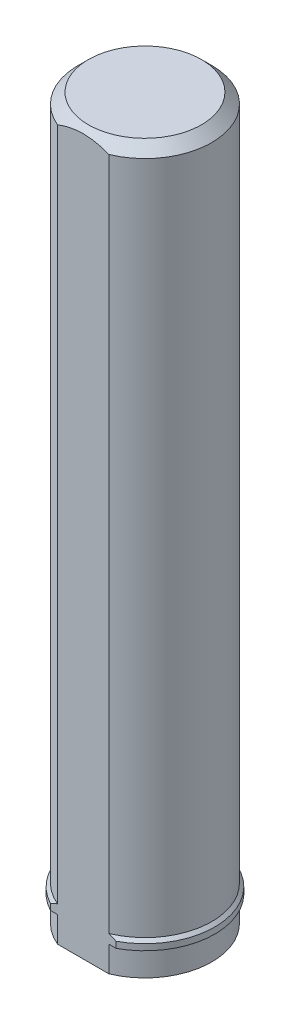
ISO-10303-21;
HEADER;
FILE_DESCRIPTION(('STEP AP214'),'2;1');
FILE_NAME('part.step','',(''),(''),'','','');
FILE_SCHEMA(('AUTOMOTIVE_DESIGN { 1 0 10303 214 1 1 1 1 }'));
ENDSEC;
DATA;
#1=APPLICATION_CONTEXT('core data for automotive mechanical design processes');
#2=APPLICATION_PROTOCOL_DEFINITION('international standard','automotive_design',2000,#1);
#3=PRODUCT_CONTEXT('',#1,'mechanical');
#4=PRODUCT('Part','Part','',(#3));
#5=PRODUCT_RELATED_PRODUCT_CATEGORY('part','',(#4));
#6=PRODUCT_DEFINITION_FORMATION('','',#4);
#7=PRODUCT_DEFINITION_CONTEXT('part definition',#1,'design');
#8=PRODUCT_DEFINITION('design','',#6,#7);
#9=PRODUCT_DEFINITION_SHAPE('','',#8);
#10=(LENGTH_UNIT() NAMED_UNIT(*) SI_UNIT(.MILLI.,.METRE.));
#11=(NAMED_UNIT(*) PLANE_ANGLE_UNIT() SI_UNIT($,.RADIAN.));
#12=(NAMED_UNIT(*) SI_UNIT($,.STERADIAN.) SOLID_ANGLE_UNIT());
#13=UNCERTAINTY_MEASURE_WITH_UNIT(LENGTH_MEASURE(1.E-05),#10,'distance_accuracy_value','');
#14=(GEOMETRIC_REPRESENTATION_CONTEXT(3) GLOBAL_UNCERTAINTY_ASSIGNED_CONTEXT((#13)) GLOBAL_UNIT_ASSIGNED_CONTEXT((#10,
#11,#12)) REPRESENTATION_CONTEXT('',''));
#15=CARTESIAN_POINT('',(0.,0.,0.));
#16=DIRECTION('',(0.,0.,1.));
#17=DIRECTION('',(1.,0.,0.));
#18=AXIS2_PLACEMENT_3D('',#15,#16,#17);
#19=CARTESIAN_POINT('',(0.,17.5,0.));
#20=DIRECTION('',(0.,-1.,0.));
#21=DIRECTION('',(0.,0.,-1.));
#22=AXIS2_PLACEMENT_3D('',#19,#20,#21);
#23=CYLINDRICAL_SURFACE('',#22,3.25);
#24=DIRECTION('',(0.,-1.,0.));
#25=VECTOR('',#24,1.);
#26=CARTESIAN_POINT('',(-1.25,17.5,3.));
#27=LINE('',#26,#25);
#28=CARTESIAN_POINT('',(-1.25,17.,3.));
#29=VERTEX_POINT('',#28);
#30=CARTESIAN_POINT('',(-1.25,-15.8,3.));
#31=VERTEX_POINT('',#30);
#32=EDGE_CURVE('E153',#29,#31,#27,.T.);
#33=ORIENTED_EDGE('',*,*,#32,.F.);
#34=CARTESIAN_POINT('',(0.,17.,0.));
#35=DIRECTION('',(0.,1.,0.));
#36=DIRECTION('',(0.,0.,1.));
#37=AXIS2_PLACEMENT_3D('',#34,#35,#36);
#38=CIRCLE('',#37,3.25);
#39=CARTESIAN_POINT('',(1.25,17.,3.));
#40=VERTEX_POINT('',#39);
#41=EDGE_CURVE('E61',#29,#40,#38,.F.);
#42=ORIENTED_EDGE('',*,*,#41,.T.);
#43=DIRECTION('',(0.,-1.,0.));
#44=VECTOR('',#43,1.);
#45=CARTESIAN_POINT('',(1.25,17.5,3.));
#46=LINE('',#45,#44);
#47=CARTESIAN_POINT('',(1.25,-15.8,3.));
#48=VERTEX_POINT('',#47);
#49=EDGE_CURVE('E149',#40,#48,#46,.T.);
#50=ORIENTED_EDGE('',*,*,#49,.T.);
#51=CARTESIAN_POINT('',(0.,-15.8,0.));
#52=DIRECTION('',(0.,-1.,0.));
#53=DIRECTION('',(0.,0.,-1.));
#54=AXIS2_PLACEMENT_3D('',#51,#52,#53);
#55=CIRCLE('',#54,3.25);
#56=EDGE_CURVE('E217',#48,#31,#55,.F.);
#57=ORIENTED_EDGE('',*,*,#56,.T.);
#58=EDGE_LOOP('',(#33,#42,#50,#57));
#59=FACE_BOUND('',#58,.T.);
#60=ADVANCED_FACE('F45',(#59),#23,.T.);
#61=CARTESIAN_POINT('',(-1.25,-16.25,3.));
#62=VERTEX_POINT('',#61);
#63=CARTESIAN_POINT('',(-1.25,-17.5,3.));
#64=VERTEX_POINT('',#63);
#65=EDGE_CURVE('E152',#62,#64,#27,.T.);
#66=ORIENTED_EDGE('',*,*,#65,.F.);
#67=CARTESIAN_POINT('',(0.,-16.25,0.));
#68=DIRECTION('',(0.,1.,0.));
#69=DIRECTION('',(0.,0.,-1.));
#70=AXIS2_PLACEMENT_3D('',#67,#68,#69);
#71=CIRCLE('',#70,3.25);
#72=CARTESIAN_POINT('',(1.25,-16.25,3.));
#73=VERTEX_POINT('',#72);
#74=EDGE_CURVE('E130',#73,#62,#71,.T.);
#75=ORIENTED_EDGE('',*,*,#74,.F.);
#76=CARTESIAN_POINT('',(1.25,-17.5,3.));
#77=VERTEX_POINT('',#76);
#78=EDGE_CURVE('E148',#73,#77,#46,.T.);
#79=ORIENTED_EDGE('',*,*,#78,.T.);
#80=CARTESIAN_POINT('',(0.,-17.5,0.));
#81=DIRECTION('',(0.,1.,0.));
#82=DIRECTION('',(0.,0.,1.));
#83=AXIS2_PLACEMENT_3D('',#80,#81,#82);
#84=CIRCLE('',#83,3.25);
#85=EDGE_CURVE('E139',#77,#64,#84,.T.);
#86=ORIENTED_EDGE('',*,*,#85,.T.);
#87=EDGE_LOOP('',(#66,#75,#79,#86));
#88=FACE_BOUND('',#87,.T.);
#89=ADVANCED_FACE('F179',(#88),#23,.T.);
#90=CARTESIAN_POINT('',(-1.25,17.5,3.));
#91=DIRECTION('',(0.,0.,-1.));
#92=DIRECTION('',(-1.,0.,0.));
#93=AXIS2_PLACEMENT_3D('',#90,#91,#92);
#94=PLANE('',#93);
#95=ORIENTED_EDGE('',*,*,#49,.F.);
#96=CARTESIAN_POINT('',(1.25,17.,3.));
#97=CARTESIAN_POINT('',(1.15236802083105,17.037571882083,3.));
#98=CARTESIAN_POINT('',(1.05336204969655,17.0718854263408,3.));
#99=CARTESIAN_POINT('',(0.852725448941351,17.1326265317615,3.));
#100=CARTESIAN_POINT('',(0.751089244504002,17.159035543992,3.));
#101=CARTESIAN_POINT('',(0.548493250122633,17.2018352585442,3.));
#102=CARTESIAN_POINT('',(0.447586877927029,17.218472843084,3.));
#103=CARTESIAN_POINT('',(0.24470611508165,17.2417200779359,3.));
#104=CARTESIAN_POINT('',(0.142732885989917,17.2483396815345,3.));
#105=CARTESIAN_POINT('',(-0.0578920074181225,17.2510614991039,3.));
#106=CARTESIAN_POINT('',(-0.156538957355599,17.247513000227,3.));
#107=CARTESIAN_POINT('',(-0.353047249224438,17.2308860418104,3.));
#108=CARTESIAN_POINT('',(-0.450908287707399,17.2178040647867,3.));
#109=CARTESIAN_POINT('',(-0.646385819993985,17.1826834722514,3.));
#110=CARTESIAN_POINT('',(-0.743980132667026,17.1605232520617,3.));
#111=CARTESIAN_POINT('',(-0.937016203307981,17.1084456394706,3.));
#112=CARTESIAN_POINT('',(-1.03245832486017,17.0785295681526,3.));
#113=CARTESIAN_POINT('',(-1.32842957153948,16.974488345219,3.));
#114=CARTESIAN_POINT('',(-1.52490969147315,16.888803613196,3.));
#115=CARTESIAN_POINT('',(-1.81250176256394,16.745966896015,3.));
#116=CARTESIAN_POINT('',(-1.90735595857642,16.6958578016377,3.));
#117=CARTESIAN_POINT('',(-2.09492458656542,16.5917743788511,3.));
#118=CARTESIAN_POINT('',(-2.18763938699844,16.5378007226841,3.));
#119=CARTESIAN_POINT('',(-2.36803930017192,16.4286608111215,3.));
#120=CARTESIAN_POINT('',(-2.45578798483039,16.3735984740863,3.));
#121=CARTESIAN_POINT('',(-2.62976374299449,16.2611083733608,3.));
#122=CARTESIAN_POINT('',(-2.71599069300599,16.2036804189419,3.));
#123=CARTESIAN_POINT('',(-2.88641961075787,16.0873609946428,3.));
#124=CARTESIAN_POINT('',(-2.97063234675973,16.0284852362516,3.));
#125=CARTESIAN_POINT('',(-3.13789321586839,15.909150340196,3.));
#126=CARTESIAN_POINT('',(-3.22094167668757,15.848691662402,3.));
#127=CARTESIAN_POINT('',(-3.30350342880287,15.7875864261465,3.));
#128=B_SPLINE_CURVE_WITH_KNOTS('',3,(#96,#97,#98,#99,#100,#101,#102,#103,#104,#105,#106,#107,
#108,#109,#110,#111,#112,#113,#114,#115,#116,#117,#118,#119,#120,#121,#122,#123,#124,#125,#126,
#127),.UNSPECIFIED.,.F.,.F.,(4,2,2,2,2,2,2,2,2,2,2,2,2,2,2,4),(0.,0.313947136940307,
0.628625314452549,0.934966611069567,1.24100334441469,1.53665464320437,1.83241508112559,
2.1322740260672,2.43208192842627,3.07316816171331,3.39497040337175,3.71671680275457,
4.02745936200872,4.33822702421672,4.64646590327196,4.9546162051363),.UNSPECIFIED.);
#129=EDGE_CURVE('E11',#40,#29,#128,.T.);
#130=ORIENTED_EDGE('',*,*,#129,.T.);
#131=ORIENTED_EDGE('',*,*,#32,.T.);
#132=CARTESIAN_POINT('',(-1.25,-15.8,3.));
#133=CARTESIAN_POINT('',(-1.27962939360583,-15.8113960988494,3.));
#134=CARTESIAN_POINT('',(-1.30914257840903,-15.823092392511,3.));
#135=CARTESIAN_POINT('',(-1.36792931558873,-15.847045652047,3.));
#136=CARTESIAN_POINT('',(-1.39720294374067,-15.8593024318564,3.));
#137=CARTESIAN_POINT('',(-1.45552217219404,-15.884344201363,3.));
#138=CARTESIAN_POINT('',(-1.48456777802003,-15.8971291782157,3.));
#139=CARTESIAN_POINT('',(-1.54244546525888,-15.9231988773122,3.));
#140=CARTESIAN_POINT('',(-1.5712774731186,-15.9364837629256,3.));
#141=CARTESIAN_POINT('',(-1.60000000000004,-15.9499999999999,3.));
#142=B_SPLINE_CURVE_WITH_KNOTS('',3,(#132,#133,#134,#135,#136,#137,#138,#139,#140,#141),
.UNSPECIFIED.,.F.,.F.,(4,2,2,2,4),(0.,0.095233642088486,0.190435895693011,0.285635835561756,
0.380867161552525),.UNSPECIFIED.);
#143=CARTESIAN_POINT('',(-1.6,-15.95,3.));
#144=VERTEX_POINT('',#143);
#145=EDGE_CURVE('E112',#31,#144,#142,.T.);
#146=ORIENTED_EDGE('',*,*,#145,.T.);
#147=DIRECTION('',(0.,-1.,0.));
#148=VECTOR('',#147,1.);
#149=CARTESIAN_POINT('',(-1.6,-15.75,3.));
#150=LINE('',#149,#148);
#151=CARTESIAN_POINT('',(-1.6,-16.25,3.));
#152=VERTEX_POINT('',#151);
#153=EDGE_CURVE('E105',#144,#152,#150,.T.);
#154=ORIENTED_EDGE('',*,*,#153,.T.);
#155=DIRECTION('',(-1.,0.,0.));
#156=VECTOR('',#155,1.);
#157=CARTESIAN_POINT('',(-1.25,-16.25,3.));
#158=LINE('',#157,#156);
#159=EDGE_CURVE('E109',#62,#152,#158,.T.);
#160=ORIENTED_EDGE('',*,*,#159,.F.);
#161=ORIENTED_EDGE('',*,*,#65,.T.);
#162=DIRECTION('',(1.,0.,0.));
#163=VECTOR('',#162,1.);
#164=CARTESIAN_POINT('',(-1.25,-17.5,3.));
#165=LINE('',#164,#163);
#166=EDGE_CURVE('E144',#64,#77,#165,.T.);
#167=ORIENTED_EDGE('',*,*,#166,.T.);
#168=ORIENTED_EDGE('',*,*,#78,.F.);
#169=DIRECTION('',(-1.,0.,0.));
#170=VECTOR('',#169,1.);
#171=CARTESIAN_POINT('',(1.25,-16.25,3.));
#172=LINE('',#171,#170);
#173=CARTESIAN_POINT('',(1.6,-16.25,3.));
#174=VERTEX_POINT('',#173);
#175=EDGE_CURVE('E118',#174,#73,#172,.T.);
#176=ORIENTED_EDGE('',*,*,#175,.F.);
#177=DIRECTION('',(0.,-1.,0.));
#178=VECTOR('',#177,1.);
#179=CARTESIAN_POINT('',(1.6,-15.75,3.));
#180=LINE('',#179,#178);
#181=CARTESIAN_POINT('',(1.6,-15.95,3.));
#182=VERTEX_POINT('',#181);
#183=EDGE_CURVE('E117',#182,#174,#180,.T.);
#184=ORIENTED_EDGE('',*,*,#183,.F.);
#185=CARTESIAN_POINT('',(1.6,-15.95,3.));
#186=CARTESIAN_POINT('',(1.57127747311858,-15.9364837629256,3.));
#187=CARTESIAN_POINT('',(1.54244546525888,-15.9231988773122,3.));
#188=CARTESIAN_POINT('',(1.48456777802004,-15.8971291782157,3.));
#189=CARTESIAN_POINT('',(1.45552217219405,-15.884344201363,3.));
#190=CARTESIAN_POINT('',(1.39720294374067,-15.8593024318564,3.));
#191=CARTESIAN_POINT('',(1.36792931558873,-15.8470456520471,3.));
#192=CARTESIAN_POINT('',(1.30914257840906,-15.823092392511,3.));
#193=CARTESIAN_POINT('',(1.2796293936059,-15.8113960988493,3.));
#194=CARTESIAN_POINT('',(1.25000000000015,-15.7999999999997,3.));
#195=B_SPLINE_CURVE_WITH_KNOTS('',3,(#185,#186,#187,#188,#189,#190,#191,#192,#193,#194),
.UNSPECIFIED.,.F.,.F.,(4,2,2,2,4),(0.,0.095231325990767,0.190431265859513,0.285633519464035,
0.38086716155251),.UNSPECIFIED.);
#196=EDGE_CURVE('E165',#182,#48,#195,.T.);
#197=ORIENTED_EDGE('',*,*,#196,.T.);
#198=EDGE_LOOP('',(#95,#130,#131,#146,#154,#160,#161,#167,#168,#176,#184,#197));
#199=FACE_BOUND('',#198,.T.);
#200=ADVANCED_FACE('F107',(#199),#94,.F.);
#201=CARTESIAN_POINT('',(0.,17.5,0.));
#202=DIRECTION('',(0.,1.,0.));
#203=DIRECTION('',(0.,0.,1.));
#204=AXIS2_PLACEMENT_3D('',#201,#202,#203);
#205=PLANE('',#204);
#206=CARTESIAN_POINT('',(0.,17.5,0.));
#207=DIRECTION('',(0.,1.,0.));
#208=DIRECTION('',(0.,0.,1.));
#209=AXIS2_PLACEMENT_3D('',#206,#207,#208);
#210=CIRCLE('',#209,2.75);
#211=CARTESIAN_POINT('',(1.05769230769231,17.5,2.53846153846154));
#212=VERTEX_POINT('',#211);
#213=EDGE_CURVE('E66',#212,#212,#210,.T.);
#214=ORIENTED_EDGE('',*,*,#213,.T.);
#215=EDGE_LOOP('',(#214));
#216=FACE_BOUND('',#215,.T.);
#217=ADVANCED_FACE('F178',(#216),#205,.T.);
#218=CARTESIAN_POINT('',(0.,-17.5,0.));
#219=DIRECTION('',(0.,1.,0.));
#220=DIRECTION('',(0.,0.,1.));
#221=AXIS2_PLACEMENT_3D('',#218,#219,#220);
#222=PLANE('',#221);
#223=ORIENTED_EDGE('',*,*,#85,.F.);
#224=ORIENTED_EDGE('',*,*,#166,.F.);
#225=EDGE_LOOP('',(#223,#224));
#226=FACE_BOUND('',#225,.T.);
#227=ADVANCED_FACE('F180',(#226),#222,.F.);
#228=CARTESIAN_POINT('',(0.,-15.75,0.));
#229=DIRECTION('',(0.,-1.,0.));
#230=DIRECTION('',(0.,0.,-1.));
#231=AXIS2_PLACEMENT_3D('',#228,#229,#230);
#232=CYLINDRICAL_SURFACE('',#231,3.4);
#233=ORIENTED_EDGE('',*,*,#153,.F.);
#234=CARTESIAN_POINT('',(0.,-15.95,0.));
#235=DIRECTION('',(0.,-1.,0.));
#236=DIRECTION('',(0.,0.,-1.));
#237=AXIS2_PLACEMENT_3D('',#234,#235,#236);
#238=CIRCLE('',#237,3.4);
#239=EDGE_CURVE('E156',#144,#182,#238,.T.);
#240=ORIENTED_EDGE('',*,*,#239,.T.);
#241=ORIENTED_EDGE('',*,*,#183,.T.);
#242=CARTESIAN_POINT('',(0.,-16.25,0.));
#243=DIRECTION('',(0.,-1.,0.));
#244=DIRECTION('',(0.,0.,-1.));
#245=AXIS2_PLACEMENT_3D('',#242,#243,#244);
#246=CIRCLE('',#245,3.4);
#247=EDGE_CURVE('E121',#152,#174,#246,.T.);
#248=ORIENTED_EDGE('',*,*,#247,.F.);
#249=EDGE_LOOP('',(#233,#240,#241,#248));
#250=FACE_BOUND('',#249,.T.);
#251=ADVANCED_FACE('F122',(#250),#232,.T.);
#252=CARTESIAN_POINT('',(0.,-16.25,0.));
#253=DIRECTION('',(0.,-1.,0.));
#254=DIRECTION('',(0.,0.,-1.));
#255=AXIS2_PLACEMENT_3D('',#252,#253,#254);
#256=PLANE('',#255);
#257=ORIENTED_EDGE('',*,*,#74,.T.);
#258=ORIENTED_EDGE('',*,*,#159,.T.);
#259=ORIENTED_EDGE('',*,*,#247,.T.);
#260=ORIENTED_EDGE('',*,*,#175,.T.);
#261=EDGE_LOOP('',(#257,#258,#259,#260));
#262=FACE_BOUND('',#261,.T.);
#263=ADVANCED_FACE('F128',(#262),#256,.T.);
#264=CARTESIAN_POINT('',(0.,-15.95,0.));
#265=DIRECTION('',(0.,-1.,0.));
#266=DIRECTION('',(0.,0.,-1.));
#267=AXIS2_PLACEMENT_3D('',#264,#265,#266);
#268=CONICAL_SURFACE('',#267,3.4,0.785398163397446);
#269=ORIENTED_EDGE('',*,*,#145,.F.);
#270=ORIENTED_EDGE('',*,*,#56,.F.);
#271=ORIENTED_EDGE('',*,*,#196,.F.);
#272=ORIENTED_EDGE('',*,*,#239,.F.);
#273=EDGE_LOOP('',(#269,#270,#271,#272));
#274=FACE_BOUND('',#273,.T.);
#275=ADVANCED_FACE('F172',(#274),#268,.T.);
#276=CARTESIAN_POINT('',(0.,17.5,0.));
#277=DIRECTION('',(0.,-1.,0.));
#278=DIRECTION('',(0.,0.,-1.));
#279=AXIS2_PLACEMENT_3D('',#276,#277,#278);
#280=CONICAL_SURFACE('',#279,2.75,0.78539816339745);
#281=ORIENTED_EDGE('',*,*,#129,.F.);
#282=ORIENTED_EDGE('',*,*,#41,.F.);
#283=EDGE_LOOP('',(#281,#282));
#284=FACE_BOUND('',#283,.T.);
#285=ORIENTED_EDGE('',*,*,#213,.F.);
#286=EDGE_LOOP('',(#285));
#287=FACE_BOUND('',#286,.T.);
#288=ADVANCED_FACE('F48',(#284,#287),#280,.T.);
#289=CLOSED_SHELL('',(#60,#89,#200,#217,#227,#251,#263,#275,#288));
#290=MANIFOLD_SOLID_BREP('B2',#289);
#291=ADVANCED_BREP_SHAPE_REPRESENTATION('',(#18,#290),#14);
#292=SHAPE_DEFINITION_REPRESENTATION(#9,#291);
ENDSEC;
END-ISO-10303-21;
